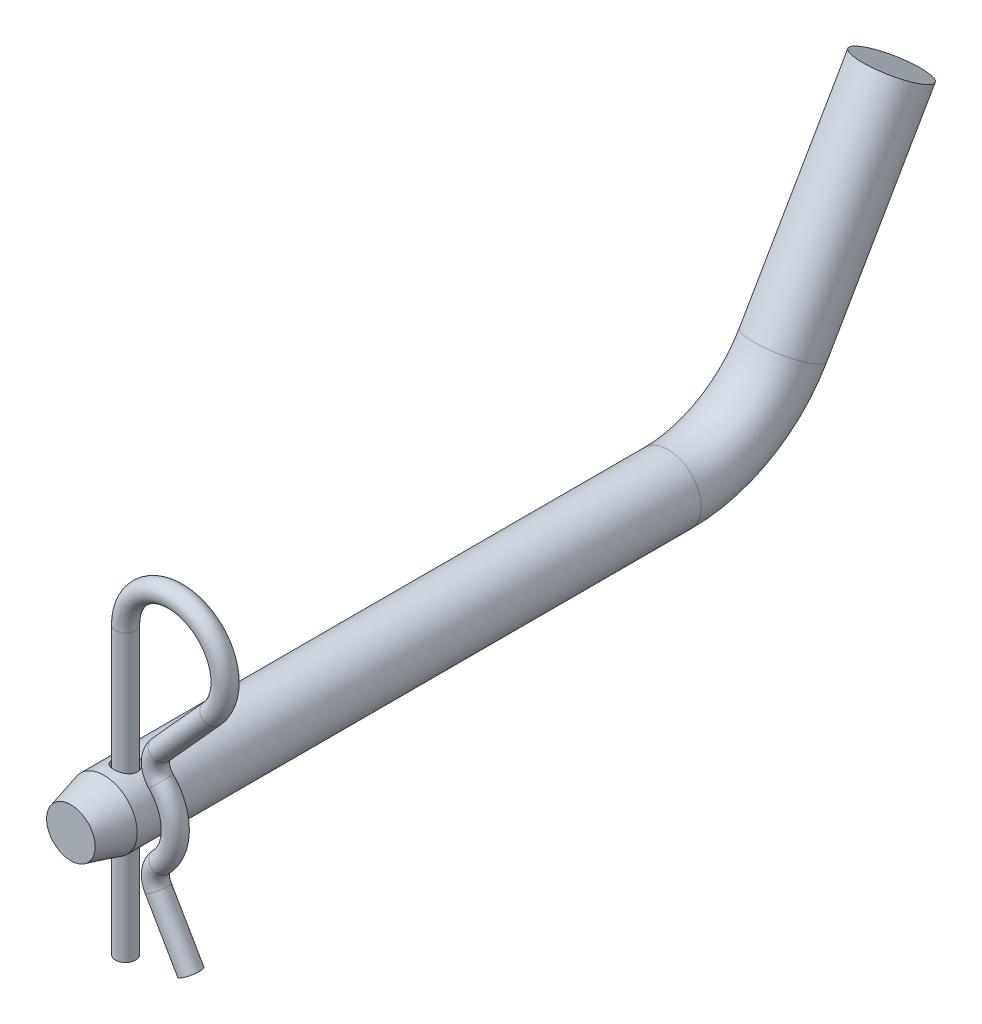
ISO-10303-21;
HEADER;
FILE_DESCRIPTION(('STEP AP214'),'2;1');
FILE_NAME('part.step','',(''),(''),'','','');
FILE_SCHEMA(('AUTOMOTIVE_DESIGN { 1 0 10303 214 1 1 1 1 }'));
ENDSEC;
DATA;
#1=APPLICATION_CONTEXT('core data for automotive mechanical design processes');
#2=APPLICATION_PROTOCOL_DEFINITION('international standard','automotive_design',2000,#1);
#3=PRODUCT_CONTEXT('',#1,'mechanical');
#4=PRODUCT('Part','Part','',(#3));
#5=PRODUCT_RELATED_PRODUCT_CATEGORY('part','',(#4));
#6=PRODUCT_DEFINITION_FORMATION('','',#4);
#7=PRODUCT_DEFINITION_CONTEXT('part definition',#1,'design');
#8=PRODUCT_DEFINITION('design','',#6,#7);
#9=PRODUCT_DEFINITION_SHAPE('','',#8);
#10=(LENGTH_UNIT() NAMED_UNIT(*) SI_UNIT(.MILLI.,.METRE.));
#11=(NAMED_UNIT(*) PLANE_ANGLE_UNIT() SI_UNIT($,.RADIAN.));
#12=(NAMED_UNIT(*) SI_UNIT($,.STERADIAN.) SOLID_ANGLE_UNIT());
#13=UNCERTAINTY_MEASURE_WITH_UNIT(LENGTH_MEASURE(1.E-05),#10,'distance_accuracy_value','');
#14=(GEOMETRIC_REPRESENTATION_CONTEXT(3) GLOBAL_UNCERTAINTY_ASSIGNED_CONTEXT((#13)) GLOBAL_UNIT_ASSIGNED_CONTEXT((#10,
#11,#12)) REPRESENTATION_CONTEXT('',''));
#15=CARTESIAN_POINT('',(0.,0.,0.));
#16=DIRECTION('',(0.,0.,1.));
#17=DIRECTION('',(1.,0.,0.));
#18=AXIS2_PLACEMENT_3D('',#15,#16,#17);
#19=CARTESIAN_POINT('',(7.80982720292864,-13.8112500000001,-6.54050000000003));
#20=DIRECTION('',(-0.499999999999979,0.866025403784451,0.));
#21=DIRECTION('',(0.866025403784451,0.499999999999979,0.));
#22=AXIS2_PLACEMENT_3D('',#19,#20,#21);
#23=PLANE('',#22);
#24=CARTESIAN_POINT('',(7.80982720292865,-13.8112500000001,-6.54050000000003));
#25=DIRECTION('',(0.499999999999992,-0.866025403784444,0.));
#26=DIRECTION('',(-0.866025403784444,-0.499999999999992,0.));
#27=AXIS2_PLACEMENT_3D('',#24,#25,#26);
#28=CIRCLE('',#27,1.190625);
#29=CARTESIAN_POINT('',(6.77871570654779,-14.4065625000001,-6.54050000000003));
#30=VERTEX_POINT('',#29);
#31=EDGE_CURVE('E47',#30,#30,#28,.F.);
#32=ORIENTED_EDGE('',*,*,#31,.F.);
#33=EDGE_LOOP('',(#32));
#34=FACE_BOUND('',#33,.T.);
#35=ADVANCED_FACE('F44',(#34),#23,.F.);
#36=CARTESIAN_POINT('',(3.89090200723833,-7.02347245000249,-6.54050000000002));
#37=DIRECTION('',(0.499999999999992,-0.866025403784444,0.));
#38=DIRECTION('',(-0.866025403784444,-0.499999999999992,0.));
#39=AXIS2_PLACEMENT_3D('',#36,#37,#38);
#40=CYLINDRICAL_SURFACE('',#39,1.190625);
#41=ORIENTED_EDGE('',*,*,#31,.T.);
#42=EDGE_LOOP('',(#41));
#43=FACE_BOUND('',#42,.T.);
#44=CARTESIAN_POINT('',(3.89090200723838,-7.02347245000259,-6.54050000000002));
#45=DIRECTION('',(0.50000000000006,-0.866025403784404,0.));
#46=DIRECTION('',(-0.866025403784404,-0.50000000000006,0.));
#47=AXIS2_PLACEMENT_3D('',#44,#45,#46);
#48=CIRCLE('',#47,1.190625);
#49=CARTESIAN_POINT('',(2.85979051085757,-7.61878495000266,-6.54050000000001));
#50=VERTEX_POINT('',#49);
#51=EDGE_CURVE('E58',#50,#50,#48,.F.);
#52=ORIENTED_EDGE('',*,*,#51,.F.);
#53=EDGE_LOOP('',(#52));
#54=FACE_BOUND('',#53,.T.);
#55=ADVANCED_FACE('F70',(#43,#54),#40,.T.);
#56=CARTESIAN_POINT('',(5.953125,-5.83284745000244,-6.54050000000002));
#57=DIRECTION('',(0.,0.,1.));
#58=DIRECTION('',(0.,-1.,0.));
#59=AXIS2_PLACEMENT_3D('',#56,#57,#58);
#60=TOROIDAL_SURFACE('',#59,2.38125,1.190625);
#61=CARTESIAN_POINT('',(4.25223214285708,-4.16631960714466,-6.54050000000002));
#62=DIRECTION('',(-0.699854212223775,-0.714285714285705,0.));
#63=DIRECTION('',(0.714285714285705,-0.699854212223775,0.));
#64=AXIS2_PLACEMENT_3D('',#61,#62,#63);
#65=CIRCLE('',#64,1.190625);
#66=CARTESIAN_POINT('',(5.1026785714285,-4.99958352857359,-6.54050000000002));
#67=VERTEX_POINT('',#66);
#68=EDGE_CURVE('E61',#67,#67,#65,.F.);
#69=ORIENTED_EDGE('',*,*,#68,.F.);
#70=EDGE_LOOP('',(#69));
#71=FACE_BOUND('',#70,.T.);
#72=ORIENTED_EDGE('',*,*,#51,.T.);
#73=EDGE_LOOP('',(#72));
#74=FACE_BOUND('',#73,.T.);
#75=ADVANCED_FACE('F66',(#71,#74),#60,.T.);
#76=CARTESIAN_POINT('',(0.,0.,-6.5405));
#77=DIRECTION('',(0.,0.,-1.));
#78=DIRECTION('',(0.,1.,0.));
#79=AXIS2_PLACEMENT_3D('',#76,#77,#78);
#80=TOROIDAL_SURFACE('',#79,5.953125,1.190625);
#81=ORIENTED_EDGE('',*,*,#68,.T.);
#82=EDGE_LOOP('',(#81));
#83=FACE_BOUND('',#82,.T.);
#84=CARTESIAN_POINT('',(4.25223214285727,4.16631960714447,-6.54050000000002));
#85=DIRECTION('',(0.699854212223821,-0.714285714285659,0.));
#86=DIRECTION('',(-0.714285714285659,-0.699854212223821,0.));
#87=AXIS2_PLACEMENT_3D('',#84,#85,#86);
#88=CIRCLE('',#87,1.190625);
#89=CARTESIAN_POINT('',(3.40178571428591,3.33305568571548,-6.54050000000001));
#90=VERTEX_POINT('',#89);
#91=EDGE_CURVE('E106',#90,#90,#88,.F.);
#92=ORIENTED_EDGE('',*,*,#91,.F.);
#93=EDGE_LOOP('',(#92));
#94=FACE_BOUND('',#93,.T.);
#95=ADVANCED_FACE('F69',(#83,#94),#80,.T.);
#96=CARTESIAN_POINT('',(5.953125,5.83284745000244,-6.54050000000002));
#97=DIRECTION('',(0.,0.,1.));
#98=DIRECTION('',(0.,-1.,0.));
#99=AXIS2_PLACEMENT_3D('',#96,#97,#98);
#100=TOROIDAL_SURFACE('',#99,2.38125,1.190625);
#101=CARTESIAN_POINT('',(4.18722998568501,7.4303349651078,-6.54050000000002));
#102=DIRECTION('',(-0.670860898731937,-0.741583208111253,0.));
#103=DIRECTION('',(-0.741583208111253,0.670860898731937,0.));
#104=AXIS2_PLACEMENT_3D('',#101,#102,#103);
#105=CIRCLE('',#104,1.190625);
#106=CARTESIAN_POINT('',(3.30428247852755,8.22907872266051,-6.54050000000001));
#107=VERTEX_POINT('',#106);
#108=EDGE_CURVE('E103',#107,#107,#105,.F.);
#109=ORIENTED_EDGE('',*,*,#108,.F.);
#110=EDGE_LOOP('',(#109));
#111=FACE_BOUND('',#110,.T.);
#112=ORIENTED_EDGE('',*,*,#91,.T.);
#113=EDGE_LOOP('',(#112));
#114=FACE_BOUND('',#113,.T.);
#115=ADVANCED_FACE('F109',(#111,#114),#100,.T.);
#116=CARTESIAN_POINT('',(10.3678625357872,14.2625312122364,-6.54050000000004));
#117=DIRECTION('',(-0.670860898731937,-0.741583208111253,0.));
#118=DIRECTION('',(-0.741583208111253,0.670860898731937,0.));
#119=AXIS2_PLACEMENT_3D('',#116,#117,#118);
#120=CYLINDRICAL_SURFACE('',#119,1.190625);
#121=ORIENTED_EDGE('',*,*,#108,.T.);
#122=EDGE_LOOP('',(#121));
#123=FACE_BOUND('',#122,.T.);
#124=CARTESIAN_POINT('',(10.3678625357872,14.2625312122364,-6.54050000000004));
#125=DIRECTION('',(-0.670860898731947,-0.741583208111244,0.));
#126=DIRECTION('',(0.741583208111244,-0.670860898731947,0.));
#127=AXIS2_PLACEMENT_3D('',#124,#125,#126);
#128=CIRCLE('',#127,1.190625);
#129=CARTESIAN_POINT('',(11.2508100429447,13.4637874546837,-6.54050000000004));
#130=VERTEX_POINT('',#129);
#131=EDGE_CURVE('E55',#130,#130,#128,.F.);
#132=ORIENTED_EDGE('',*,*,#131,.F.);
#133=EDGE_LOOP('',(#132));
#134=FACE_BOUND('',#133,.T.);
#135=ADVANCED_FACE('F97',(#123,#134),#120,.T.);
#136=CARTESIAN_POINT('',(5.95312499999999,18.25625,-6.54050000000002));
#137=DIRECTION('',(0.,0.,-1.));
#138=DIRECTION('',(0.,1.,0.));
#139=AXIS2_PLACEMENT_3D('',#136,#137,#138);
#140=TOROIDAL_SURFACE('',#139,5.95312499999999,1.190625);
#141=ORIENTED_EDGE('',*,*,#131,.T.);
#142=EDGE_LOOP('',(#141));
#143=FACE_BOUND('',#142,.T.);
#144=CARTESIAN_POINT('',(0.,18.25625,-6.5405));
#145=DIRECTION('',(0.,-1.,0.));
#146=DIRECTION('',(-1.,0.,0.));
#147=AXIS2_PLACEMENT_3D('',#144,#145,#146);
#148=CIRCLE('',#147,1.190625);
#149=CARTESIAN_POINT('',(-1.190625,18.25625,-6.5405));
#150=VERTEX_POINT('',#149);
#151=EDGE_CURVE('E51',#150,#150,#148,.T.);
#152=ORIENTED_EDGE('',*,*,#151,.F.);
#153=EDGE_LOOP('',(#152));
#154=FACE_BOUND('',#153,.T.);
#155=ADVANCED_FACE('F89',(#143,#154),#140,.T.);
#156=CARTESIAN_POINT('',(0.,-15.875,-6.5405));
#157=DIRECTION('',(0.,-1.,0.));
#158=DIRECTION('',(0.,0.,-1.));
#159=AXIS2_PLACEMENT_3D('',#156,#157,#158);
#160=PLANE('',#159);
#161=CARTESIAN_POINT('',(0.,-15.875,-6.5405));
#162=DIRECTION('',(0.,-1.,0.));
#163=DIRECTION('',(-1.,0.,0.));
#164=AXIS2_PLACEMENT_3D('',#161,#162,#163);
#165=CIRCLE('',#164,1.190625);
#166=CARTESIAN_POINT('',(-1.190625,-15.875,-6.5405));
#167=VERTEX_POINT('',#166);
#168=EDGE_CURVE('E11',#167,#167,#165,.F.);
#169=ORIENTED_EDGE('',*,*,#168,.F.);
#170=EDGE_LOOP('',(#169));
#171=FACE_BOUND('',#170,.T.);
#172=ADVANCED_FACE('F84',(#171),#160,.T.);
#173=CARTESIAN_POINT('',(0.,18.25625,-6.5405));
#174=DIRECTION('',(0.,-1.,0.));
#175=DIRECTION('',(-1.,0.,0.));
#176=AXIS2_PLACEMENT_3D('',#173,#174,#175);
#177=CYLINDRICAL_SURFACE('',#176,1.190625);
#178=ORIENTED_EDGE('',*,*,#168,.T.);
#179=EDGE_LOOP('',(#178));
#180=FACE_BOUND('',#179,.T.);
#181=ORIENTED_EDGE('',*,*,#151,.T.);
#182=EDGE_LOOP('',(#181));
#183=FACE_BOUND('',#182,.T.);
#184=ADVANCED_FACE('F82',(#180,#183),#177,.T.);
#185=CLOSED_SHELL('',(#35,#55,#75,#95,#115,#135,#155,#172,#184));
#186=MANIFOLD_SOLID_BREP('B2',#185);
#187=CARTESIAN_POINT('',(0.,0.,-71.4375));
#188=DIRECTION('',(0.,0.,1.));
#189=DIRECTION('',(1.,0.,0.));
#190=AXIS2_PLACEMENT_3D('',#187,#188,#189);
#191=CYLINDRICAL_SURFACE('',#190,3.96875);
#192=CARTESIAN_POINT('',(0.,-3.96875,-5.1435));
#193=CARTESIAN_POINT('',(0.0759774602565093,-3.96875091104805,-5.14349871125747));
#194=CARTESIAN_POINT('',(0.151945716884068,-3.96654860031479,-5.14971803826557));
#195=CARTESIAN_POINT('',(0.301630007332047,-3.95798137393654,-5.17434433776716));
#196=CARTESIAN_POINT('',(0.375346057994246,-3.95161648942686,-5.19275121909994));
#197=CARTESIAN_POINT('',(0.518346380357039,-3.93541210631879,-5.2410332940472));
#198=CARTESIAN_POINT('',(0.587638308267464,-3.92557881371093,-5.2708880124114));
#199=CARTESIAN_POINT('',(0.720229397850701,-3.9034305946826,-5.34112068245136));
#200=CARTESIAN_POINT('',(0.783527171849555,-3.89111509567438,-5.381501062786));
#201=CARTESIAN_POINT('',(0.904744448382224,-3.86476330693403,-5.47325062896884));
#202=CARTESIAN_POINT('',(0.962404597209541,-3.85068244624528,-5.52494957005042));
#203=CARTESIAN_POINT('',(1.06843936340697,-3.82262056228789,-5.6371682530825));
#204=CARTESIAN_POINT('',(1.11681160758462,-3.80863956541215,-5.69769024251685));
#205=CARTESIAN_POINT('',(1.20445013790801,-3.78185796055576,-5.82825794641144));
#206=CARTESIAN_POINT('',(1.24336666694181,-3.76911094684581,-5.89855049279885));
#207=CARTESIAN_POINT('',(1.3087124047442,-3.74692515367082,-6.0452035286542));
#208=CARTESIAN_POINT('',(1.33514592986057,-3.73748523097845,-6.12156191000534));
#209=CARTESIAN_POINT('',(1.37377999404982,-3.72345484765629,-6.27521202210032));
#210=CARTESIAN_POINT('',(1.3864706850224,-3.71869797522245,-6.35236483498724));
#211=CARTESIAN_POINT('',(1.39879152439406,-3.71408216896291,-6.50784017398587));
#212=CARTESIAN_POINT('',(1.3984262750168,-3.71422150922019,-6.58616227819076));
#213=CARTESIAN_POINT('',(1.38502361765856,-3.719237565022,-6.73744535808684));
#214=CARTESIAN_POINT('',(1.37264268079165,-3.72386885712299,-6.810474083555));
#215=CARTESIAN_POINT('',(1.33663724546325,-3.73694266336586,-6.95334234983602));
#216=CARTESIAN_POINT('',(1.31301125382853,-3.74538568363994,-7.02318146576684));
#217=CARTESIAN_POINT('',(1.2547874401487,-3.76529445898588,-7.15911211977791));
#218=CARTESIAN_POINT('',(1.22000582101194,-3.77681026425572,-7.22511728101312));
#219=CARTESIAN_POINT('',(1.14058579902615,-3.80154796502975,-7.35055432361559));
#220=CARTESIAN_POINT('',(1.09594429536607,-3.81477039670182,-7.40998412827044));
#221=CARTESIAN_POINT('',(0.994983871795237,-3.84237880465267,-7.52424928363145));
#222=CARTESIAN_POINT('',(0.938133610481523,-3.85678753881415,-7.5786107061001));
#223=CARTESIAN_POINT('',(0.815950340350371,-3.88447177361961,-7.67715951015692));
#224=CARTESIAN_POINT('',(0.750616321061658,-3.89774713895922,-7.72134567806398));
#225=CARTESIAN_POINT('',(0.612226990144665,-3.92187976448894,-7.79873098166593));
#226=CARTESIAN_POINT('',(0.539087356605644,-3.93270561657669,-7.83178980113195));
#227=CARTESIAN_POINT('',(0.38781082917186,-3.95048954869215,-7.88498252550923));
#228=CARTESIAN_POINT('',(0.309675893313559,-3.95744913396221,-7.9051214609546));
#229=CARTESIAN_POINT('',(0.154628742075337,-3.96646035832837,-7.93103222283719));
#230=CARTESIAN_POINT('',(0.0778359376103724,-3.96873024076048,-7.93744344865518));
#231=CARTESIAN_POINT('',(-0.0757518964350139,-3.96876948574009,-7.93755577427796));
#232=CARTESIAN_POINT('',(-0.152546922783102,-3.96653970863894,-7.93125930384063));
#233=CARTESIAN_POINT('',(-0.301311841418078,-3.95797442264485,-7.90663285550406));
#234=CARTESIAN_POINT('',(-0.373357334781973,-3.95177680597206,-7.88870676657001));
#235=CARTESIAN_POINT('',(-0.513380193267747,-3.93603675724455,-7.84184650840708));
#236=CARTESIAN_POINT('',(-0.581357030085722,-3.92649389191678,-7.8129109131972));
#237=CARTESIAN_POINT('',(-0.713426225022658,-3.9046903191072,-7.74396803411667));
#238=CARTESIAN_POINT('',(-0.777357847209078,-3.89236137018132,-7.70367505795834));
#239=CARTESIAN_POINT('',(-0.897753474537749,-3.8663697318845,-7.61349087109567));
#240=CARTESIAN_POINT('',(-0.954214966170577,-3.85270659626767,-7.56359644353673));
#241=CARTESIAN_POINT('',(-1.06106720715371,-3.82469868484327,-7.45262660105773));
#242=CARTESIAN_POINT('',(-1.11100230114272,-3.81035463456849,-7.39111114806675));
#243=CARTESIAN_POINT('',(-1.1999118718618,-3.78329942231145,-7.26027469144774));
#244=CARTESIAN_POINT('',(-1.2388859234439,-3.77058832367717,-7.19095338519864));
#245=CARTESIAN_POINT('',(-1.30466774944148,-3.74833719580971,-7.04623462365554));
#246=CARTESIAN_POINT('',(-1.33147183695984,-3.73879812777879,-6.97083533516895));
#247=CARTESIAN_POINT('',(-1.37185745027419,-3.72417158977744,-6.8161722938733));
#248=CARTESIAN_POINT('',(-1.38544586548284,-3.71908180051032,-6.73691057722776));
#249=CARTESIAN_POINT('',(-1.39844084582665,-3.71421366218125,-6.58164240042549));
#250=CARTESIAN_POINT('',(-1.398612530051,-3.71414875978909,-6.5057083253263));
#251=CARTESIAN_POINT('',(-1.38668597509473,-3.71861778352205,-6.3549550290863));
#252=CARTESIAN_POINT('',(-1.374588637398,-3.72315137176653,-6.28013572644582));
#253=CARTESIAN_POINT('',(-1.33903407165499,-3.73608173770832,-6.13551415202068));
#254=CARTESIAN_POINT('',(-1.31585235328286,-3.74438458723043,-6.06563506542727));
#255=CARTESIAN_POINT('',(-1.25901802216526,-3.76387411905338,-5.93070897477709));
#256=CARTESIAN_POINT('',(-1.22536292953378,-3.77506148424228,-5.86566311965642));
#257=CARTESIAN_POINT('',(-1.1466705435132,-3.79972344076991,-5.7388866570617));
#258=CARTESIAN_POINT('',(-1.10116736960508,-3.8132816073067,-5.67746163159307));
#259=CARTESIAN_POINT('',(-1.00082862862601,-3.84083617800978,-5.56287304706989));
#260=CARTESIAN_POINT('',(-0.94599028044732,-3.85483271175619,-5.50971195903929));
#261=CARTESIAN_POINT('',(-0.825558581709816,-3.88244896502109,-5.41071814129774));
#262=CARTESIAN_POINT('',(-0.759590378164251,-3.89602284020261,-5.36532686516738));
#263=CARTESIAN_POINT('',(-0.620498169674063,-3.92057884162536,-5.28631280733604));
#264=CARTESIAN_POINT('',(-0.547375001751938,-3.93156127051498,-5.25268865116138));
#265=CARTESIAN_POINT('',(-0.396502838696993,-3.94961892101536,-5.19857163829418));
#266=CARTESIAN_POINT('',(-0.318787948017686,-3.95671971309949,-5.17799269849078));
#267=CARTESIAN_POINT('',(-0.160711293599137,-3.96628393041371,-5.15046003013484));
#268=CARTESIAN_POINT('',(-0.0803505000062432,-3.9687490365147,-5.14350136291878));
#269=CARTESIAN_POINT('',(0.,-3.96875,-5.1435));
#270=B_SPLINE_CURVE_WITH_KNOTS('',3,(#192,#193,#194,#195,#196,#197,#198,#199,#200,#201,#202,
#203,#204,#205,#206,#207,#208,#209,#210,#211,#212,#213,#214,#215,#216,#217,#218,#219,#220,#221,
#222,#223,#224,#225,#226,#227,#228,#229,#230,#231,#232,#233,#234,#235,#236,#237,#238,#239,#240,
#241,#242,#243,#244,#245,#246,#247,#248,#249,#250,#251,#252,#253,#254,#255,#256,#257,#258,#259,
#260,#261,#262,#263,#264,#265,#266,#267,#268,#269),.UNSPECIFIED.,.T.,.F.,(4,2,2,2,2,2,2,2,2,2,2,
2,2,2,2,2,2,2,2,2,2,2,2,2,2,2,2,2,2,2,2,2,2,2,2,2,2,2,4),(0.,0.227636384595209,
0.455271066530657,0.682500492930632,0.909782396032191,1.14486964753933,1.38001688749803,
1.62285858430146,1.86561625020104,2.09939744028889,2.33309622323615,2.55470644947889,
2.77634611042143,3.0018431803696,3.22741126757339,3.46620961611916,3.7050364332497,
3.94677095437414,4.18841129562885,4.41852713609097,4.64859898173318,4.87107981736834,
5.09358947913769,5.322291069001,5.55106941649833,5.79149981244602,6.03193953272623,
6.27245204582495,6.51283911093329,6.73950694045503,6.96615811644124,7.18744743539879,
7.40878919116956,7.64067607564829,7.87263216447706,8.11510326619927,8.35754603630998,
8.59837184227172,8.83911030944457),.UNSPECIFIED.);
#271=CARTESIAN_POINT('',(0.,-3.96875,-5.1435));
#272=VERTEX_POINT('',#271);
#273=EDGE_CURVE('E212',#272,#272,#270,.T.);
#274=ORIENTED_EDGE('',*,*,#273,.T.);
#275=EDGE_LOOP('',(#274));
#276=FACE_BOUND('',#275,.T.);
#277=CARTESIAN_POINT('',(0.,0.,-3.96875));
#278=DIRECTION('',(0.,0.,1.));
#279=DIRECTION('',(0.,-1.,0.));
#280=AXIS2_PLACEMENT_3D('',#277,#278,#279);
#281=CIRCLE('',#280,3.96875);
#282=CARTESIAN_POINT('',(0.,-3.96875,-3.96875));
#283=VERTEX_POINT('',#282);
#284=EDGE_CURVE('E257',#283,#283,#281,.T.);
#285=ORIENTED_EDGE('',*,*,#284,.F.);
#286=EDGE_LOOP('',(#285));
#287=FACE_BOUND('',#286,.T.);
#288=CARTESIAN_POINT('',(0.,0.,-71.4375));
#289=DIRECTION('',(0.,0.,1.));
#290=DIRECTION('',(1.,0.,0.));
#291=AXIS2_PLACEMENT_3D('',#288,#289,#290);
#292=CIRCLE('',#291,3.96875);
#293=CARTESIAN_POINT('',(0.,-3.96875,-71.4375));
#294=VERTEX_POINT('',#293);
#295=EDGE_CURVE('E260',#294,#294,#292,.T.);
#296=ORIENTED_EDGE('',*,*,#295,.T.);
#297=EDGE_LOOP('',(#296));
#298=FACE_BOUND('',#297,.T.);
#299=CARTESIAN_POINT('',(0.,3.96875,-5.1435));
#300=CARTESIAN_POINT('',(-0.0759774602565093,3.96875091104805,-5.14349871125747));
#301=CARTESIAN_POINT('',(-0.151945716884068,3.96654860031479,-5.14971803826557));
#302=CARTESIAN_POINT('',(-0.301630007332047,3.95798137393654,-5.17434433776716));
#303=CARTESIAN_POINT('',(-0.375346057994246,3.95161648942686,-5.19275121909994));
#304=CARTESIAN_POINT('',(-0.518346380357039,3.93541210631879,-5.2410332940472));
#305=CARTESIAN_POINT('',(-0.587638308267464,3.92557881371093,-5.2708880124114));
#306=CARTESIAN_POINT('',(-0.720229397850701,3.9034305946826,-5.34112068245136));
#307=CARTESIAN_POINT('',(-0.783527171849555,3.89111509567438,-5.381501062786));
#308=CARTESIAN_POINT('',(-0.904744448382224,3.86476330693403,-5.47325062896884));
#309=CARTESIAN_POINT('',(-0.962404597209541,3.85068244624528,-5.52494957005042));
#310=CARTESIAN_POINT('',(-1.06843936340697,3.82262056228789,-5.6371682530825));
#311=CARTESIAN_POINT('',(-1.11681160758462,3.80863956541215,-5.69769024251685));
#312=CARTESIAN_POINT('',(-1.20445013790801,3.78185796055576,-5.82825794641144));
#313=CARTESIAN_POINT('',(-1.24336666694181,3.76911094684581,-5.89855049279885));
#314=CARTESIAN_POINT('',(-1.3087124047442,3.74692515367082,-6.0452035286542));
#315=CARTESIAN_POINT('',(-1.33514592986057,3.73748523097845,-6.12156191000534));
#316=CARTESIAN_POINT('',(-1.37377999404982,3.72345484765629,-6.27521202210032));
#317=CARTESIAN_POINT('',(-1.3864706850224,3.71869797522245,-6.35236483498724));
#318=CARTESIAN_POINT('',(-1.39879152439406,3.71408216896291,-6.50784017398587));
#319=CARTESIAN_POINT('',(-1.3984262750168,3.71422150922019,-6.58616227819076));
#320=CARTESIAN_POINT('',(-1.38502361765856,3.719237565022,-6.73744535808684));
#321=CARTESIAN_POINT('',(-1.37264268079165,3.72386885712299,-6.810474083555));
#322=CARTESIAN_POINT('',(-1.33663724546325,3.73694266336586,-6.95334234983602));
#323=CARTESIAN_POINT('',(-1.31301125382853,3.74538568363994,-7.02318146576684));
#324=CARTESIAN_POINT('',(-1.2547874401487,3.76529445898588,-7.15911211977791));
#325=CARTESIAN_POINT('',(-1.22000582101194,3.77681026425572,-7.22511728101312));
#326=CARTESIAN_POINT('',(-1.14058579902615,3.80154796502975,-7.35055432361559));
#327=CARTESIAN_POINT('',(-1.09594429536607,3.81477039670182,-7.40998412827044));
#328=CARTESIAN_POINT('',(-0.994983871795237,3.84237880465267,-7.52424928363145));
#329=CARTESIAN_POINT('',(-0.938133610481523,3.85678753881415,-7.5786107061001));
#330=CARTESIAN_POINT('',(-0.815950340350371,3.88447177361961,-7.67715951015692));
#331=CARTESIAN_POINT('',(-0.750616321061658,3.89774713895922,-7.72134567806398));
#332=CARTESIAN_POINT('',(-0.612226990144665,3.92187976448894,-7.79873098166593));
#333=CARTESIAN_POINT('',(-0.539087356605644,3.93270561657669,-7.83178980113195));
#334=CARTESIAN_POINT('',(-0.38781082917186,3.95048954869215,-7.88498252550923));
#335=CARTESIAN_POINT('',(-0.309675893313559,3.95744913396221,-7.9051214609546));
#336=CARTESIAN_POINT('',(-0.154628742075337,3.96646035832837,-7.93103222283719));
#337=CARTESIAN_POINT('',(-0.0778359376103724,3.96873024076048,-7.93744344865518));
#338=CARTESIAN_POINT('',(0.0757518964350139,3.96876948574009,-7.93755577427796));
#339=CARTESIAN_POINT('',(0.152546922783102,3.96653970863894,-7.93125930384063));
#340=CARTESIAN_POINT('',(0.301311841418078,3.95797442264485,-7.90663285550406));
#341=CARTESIAN_POINT('',(0.373357334781973,3.95177680597206,-7.88870676657001));
#342=CARTESIAN_POINT('',(0.513380193267747,3.93603675724455,-7.84184650840708));
#343=CARTESIAN_POINT('',(0.581357030085722,3.92649389191678,-7.8129109131972));
#344=CARTESIAN_POINT('',(0.713426225022658,3.9046903191072,-7.74396803411667));
#345=CARTESIAN_POINT('',(0.777357847209078,3.89236137018132,-7.70367505795834));
#346=CARTESIAN_POINT('',(0.897753474537749,3.8663697318845,-7.61349087109567));
#347=CARTESIAN_POINT('',(0.954214966170577,3.85270659626767,-7.56359644353673));
#348=CARTESIAN_POINT('',(1.06106720715371,3.82469868484327,-7.45262660105773));
#349=CARTESIAN_POINT('',(1.11100230114272,3.81035463456849,-7.39111114806675));
#350=CARTESIAN_POINT('',(1.1999118718618,3.78329942231145,-7.26027469144774));
#351=CARTESIAN_POINT('',(1.2388859234439,3.77058832367717,-7.19095338519864));
#352=CARTESIAN_POINT('',(1.30466774944148,3.74833719580971,-7.04623462365554));
#353=CARTESIAN_POINT('',(1.33147183695984,3.73879812777879,-6.97083533516895));
#354=CARTESIAN_POINT('',(1.37185745027419,3.72417158977744,-6.8161722938733));
#355=CARTESIAN_POINT('',(1.38544586548284,3.71908180051032,-6.73691057722776));
#356=CARTESIAN_POINT('',(1.39844084582665,3.71421366218125,-6.58164240042549));
#357=CARTESIAN_POINT('',(1.398612530051,3.71414875978909,-6.5057083253263));
#358=CARTESIAN_POINT('',(1.38668597509473,3.71861778352205,-6.3549550290863));
#359=CARTESIAN_POINT('',(1.374588637398,3.72315137176653,-6.28013572644582));
#360=CARTESIAN_POINT('',(1.33903407165499,3.73608173770832,-6.13551415202068));
#361=CARTESIAN_POINT('',(1.31585235328286,3.74438458723043,-6.06563506542727));
#362=CARTESIAN_POINT('',(1.25901802216526,3.76387411905338,-5.93070897477709));
#363=CARTESIAN_POINT('',(1.22536292953378,3.77506148424228,-5.86566311965642));
#364=CARTESIAN_POINT('',(1.1466705435132,3.79972344076991,-5.7388866570617));
#365=CARTESIAN_POINT('',(1.10116736960508,3.8132816073067,-5.67746163159307));
#366=CARTESIAN_POINT('',(1.00082862862601,3.84083617800978,-5.56287304706989));
#367=CARTESIAN_POINT('',(0.94599028044732,3.85483271175619,-5.50971195903929));
#368=CARTESIAN_POINT('',(0.825558581709816,3.88244896502109,-5.41071814129774));
#369=CARTESIAN_POINT('',(0.759590378164251,3.89602284020261,-5.36532686516738));
#370=CARTESIAN_POINT('',(0.620498169674063,3.92057884162536,-5.28631280733604));
#371=CARTESIAN_POINT('',(0.547375001751938,3.93156127051498,-5.25268865116138));
#372=CARTESIAN_POINT('',(0.396502838696993,3.94961892101536,-5.19857163829418));
#373=CARTESIAN_POINT('',(0.318787948017686,3.95671971309949,-5.17799269849078));
#374=CARTESIAN_POINT('',(0.160711293599137,3.96628393041371,-5.15046003013484));
#375=CARTESIAN_POINT('',(0.0803505000062432,3.9687490365147,-5.14350136291878));
#376=CARTESIAN_POINT('',(0.,3.96875,-5.1435));
#377=B_SPLINE_CURVE_WITH_KNOTS('',3,(#299,#300,#301,#302,#303,#304,#305,#306,#307,#308,#309,
#310,#311,#312,#313,#314,#315,#316,#317,#318,#319,#320,#321,#322,#323,#324,#325,#326,#327,#328,
#329,#330,#331,#332,#333,#334,#335,#336,#337,#338,#339,#340,#341,#342,#343,#344,#345,#346,#347,
#348,#349,#350,#351,#352,#353,#354,#355,#356,#357,#358,#359,#360,#361,#362,#363,#364,#365,#366,
#367,#368,#369,#370,#371,#372,#373,#374,#375,#376),.UNSPECIFIED.,.T.,.F.,(4,2,2,2,2,2,2,2,2,2,2,
2,2,2,2,2,2,2,2,2,2,2,2,2,2,2,2,2,2,2,2,2,2,2,2,2,2,2,4),(0.,0.227636384595209,
0.455271066530657,0.682500492930632,0.909782396032191,1.14486964753933,1.38001688749803,
1.62285858430146,1.86561625020104,2.09939744028889,2.33309622323615,2.55470644947889,
2.77634611042143,3.0018431803696,3.22741126757339,3.46620961611916,3.7050364332497,
3.94677095437414,4.18841129562885,4.41852713609097,4.64859898173318,4.87107981736834,
5.09358947913769,5.322291069001,5.55106941649833,5.79149981244602,6.03193953272623,
6.27245204582495,6.51283911093329,6.73950694045503,6.96615811644124,7.18744743539879,
7.40878919116956,7.64067607564829,7.87263216447706,8.11510326619927,8.35754603630998,
8.59837184227172,8.83911030944457),.UNSPECIFIED.);
#378=CARTESIAN_POINT('',(0.,3.96875,-5.1435));
#379=VERTEX_POINT('',#378);
#380=EDGE_CURVE('E43',#379,#379,#377,.T.);
#381=ORIENTED_EDGE('',*,*,#380,.T.);
#382=EDGE_LOOP('',(#381));
#383=FACE_BOUND('',#382,.T.);
#384=ADVANCED_FACE('F200',(#276,#287,#298,#383),#191,.T.);
#385=CARTESIAN_POINT('',(0.,7.93750000000003,-85.185653285078));
#386=DIRECTION('',(0.,0.86602540378444,-0.499999999999997));
#387=DIRECTION('',(0.,0.499999999999997,0.86602540378444));
#388=AXIS2_PLACEMENT_3D('',#385,#386,#387);
#389=CYLINDRICAL_SURFACE('',#388,3.96875);
#390=CARTESIAN_POINT('',(0.,7.93750000000003,-85.185653285078));
#391=DIRECTION('',(0.,-0.866025403784439,0.499999999999999));
#392=DIRECTION('',(1.,0.,0.));
#393=AXIS2_PLACEMENT_3D('',#390,#391,#392);
#394=CIRCLE('',#393,3.96875);
#395=CARTESIAN_POINT('',(0.,5.95312500000004,-88.6226916063475));
#396=VERTEX_POINT('',#395);
#397=EDGE_CURVE('E220',#396,#396,#394,.T.);
#398=ORIENTED_EDGE('',*,*,#397,.F.);
#399=EDGE_LOOP('',(#398));
#400=FACE_BOUND('',#399,.T.);
#401=CARTESIAN_POINT('',(0.,30.4148574832964,-98.1629616787305));
#402=DIRECTION('',(0.,-0.866025403784439,0.499999999999999));
#403=DIRECTION('',(1.,0.,0.));
#404=AXIS2_PLACEMENT_3D('',#401,#402,#403);
#405=CIRCLE('',#404,3.96875);
#406=CARTESIAN_POINT('',(3.96875,30.4148574832964,-98.1629616787305));
#407=VERTEX_POINT('',#406);
#408=EDGE_CURVE('E216',#407,#407,#405,.T.);
#409=ORIENTED_EDGE('',*,*,#408,.T.);
#410=EDGE_LOOP('',(#409));
#411=FACE_BOUND('',#410,.T.);
#412=ADVANCED_FACE('F202',(#400,#411),#389,.T.);
#413=CARTESIAN_POINT('',(0.,15.875,-71.4375));
#414=DIRECTION('',(1.,0.,0.));
#415=DIRECTION('',(0.,0.,-1.));
#416=AXIS2_PLACEMENT_3D('',#413,#414,#415);
#417=TOROIDAL_SURFACE('',#416,15.875,3.96875);
#418=CARTESIAN_POINT('',(0.,15.875,-71.4375));
#419=DIRECTION('',(1.,0.,0.));
#420=DIRECTION('',(0.,0.,-1.));
#421=AXIS2_PLACEMENT_3D('',#418,#419,#420);
#422=CIRCLE('',#421,19.84375);
#423=EDGE_CURVE('',#294,#396,#422,.T.);
#424=ORIENTED_EDGE('',*,*,#295,.F.);
#425=ORIENTED_EDGE('',*,*,#397,.T.);
#426=ORIENTED_EDGE('',*,*,#423,.T.);
#427=ORIENTED_EDGE('',*,*,#423,.F.);
#428=EDGE_LOOP('',(#424,#426,#425,#427));
#429=FACE_BOUND('',#428,.T.);
#430=ADVANCED_FACE('F241',(#429),#417,.T.);
#431=CARTESIAN_POINT('',(0.,30.4148574832964,-98.1629616787305));
#432=DIRECTION('',(0.,-0.866025403784439,0.499999999999999));
#433=DIRECTION('',(1.,0.,0.));
#434=AXIS2_PLACEMENT_3D('',#431,#432,#433);
#435=PLANE('',#434);
#436=ORIENTED_EDGE('',*,*,#408,.F.);
#437=EDGE_LOOP('',(#436));
#438=FACE_BOUND('',#437,.T.);
#439=ADVANCED_FACE('F238',(#438),#435,.F.);
#440=CARTESIAN_POINT('',(0.,0.,0.));
#441=DIRECTION('',(0.,0.,-1.));
#442=DIRECTION('',(0.,1.,0.));
#443=AXIS2_PLACEMENT_3D('',#440,#441,#442);
#444=CONICAL_SURFACE('',#443,2.90532664253901,0.261799387799143);
#445=ORIENTED_EDGE('',*,*,#284,.T.);
#446=EDGE_LOOP('',(#445));
#447=FACE_BOUND('',#446,.T.);
#448=CARTESIAN_POINT('',(0.,0.,0.));
#449=DIRECTION('',(0.,0.,1.));
#450=DIRECTION('',(0.,-1.,0.));
#451=AXIS2_PLACEMENT_3D('',#448,#449,#450);
#452=CIRCLE('',#451,2.90532664253901);
#453=CARTESIAN_POINT('',(0.,-2.90532664253901,0.));
#454=VERTEX_POINT('',#453);
#455=EDGE_CURVE('E264',#454,#454,#452,.T.);
#456=ORIENTED_EDGE('',*,*,#455,.F.);
#457=EDGE_LOOP('',(#456));
#458=FACE_BOUND('',#457,.T.);
#459=ADVANCED_FACE('F234',(#447,#458),#444,.T.);
#460=CARTESIAN_POINT('',(0.,0.,0.));
#461=DIRECTION('',(0.,0.,1.));
#462=DIRECTION('',(1.,0.,0.));
#463=AXIS2_PLACEMENT_3D('',#460,#461,#462);
#464=PLANE('',#463);
#465=ORIENTED_EDGE('',*,*,#455,.T.);
#466=EDGE_LOOP('',(#465));
#467=FACE_BOUND('',#466,.T.);
#468=ADVANCED_FACE('F232',(#467),#464,.T.);
#469=CARTESIAN_POINT('',(0.,3.96875,-6.5405));
#470=DIRECTION('',(0.,1.,0.));
#471=DIRECTION('',(0.,0.,1.));
#472=AXIS2_PLACEMENT_3D('',#469,#470,#471);
#473=CYLINDRICAL_SURFACE('',#472,1.397);
#474=ORIENTED_EDGE('',*,*,#380,.F.);
#475=EDGE_LOOP('',(#474));
#476=FACE_BOUND('',#475,.T.);
#477=ORIENTED_EDGE('',*,*,#273,.F.);
#478=EDGE_LOOP('',(#477));
#479=FACE_BOUND('',#478,.T.);
#480=ADVANCED_FACE('F228',(#476,#479),#473,.F.);
#481=CLOSED_SHELL('',(#384,#412,#430,#439,#459,#468,#480));
#482=MANIFOLD_SOLID_BREP('B6',#481);
#483=ADVANCED_BREP_SHAPE_REPRESENTATION('',(#18,#186,#482),#14);
#484=SHAPE_DEFINITION_REPRESENTATION(#9,#483);
ENDSEC;
END-ISO-10303-21;
